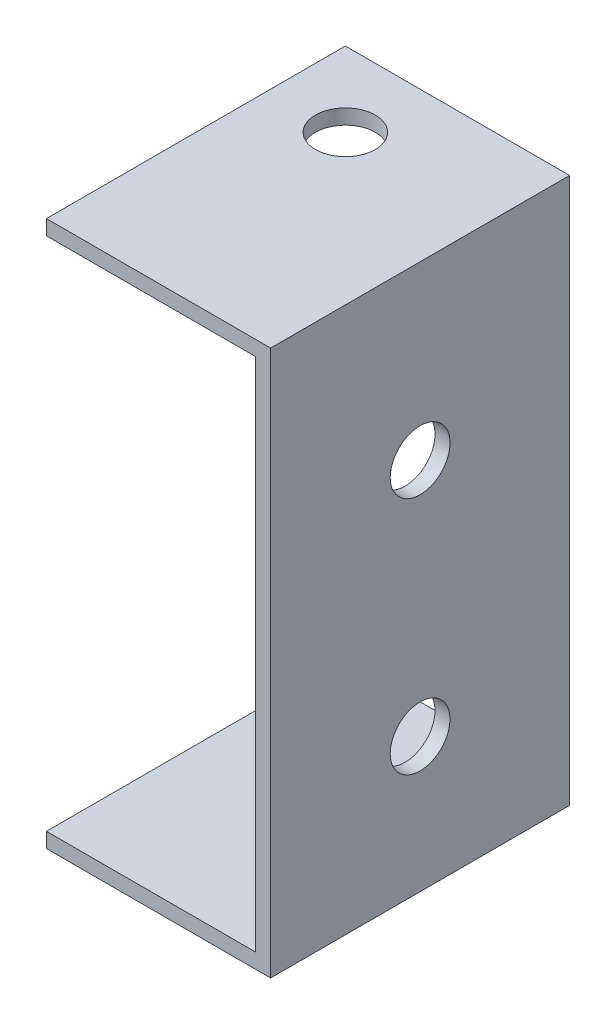
ISO-10303-21;
HEADER;
FILE_DESCRIPTION(('STEP AP214'),'2;1');
FILE_NAME('part.step','',(''),(''),'','','');
FILE_SCHEMA(('AUTOMOTIVE_DESIGN { 1 0 10303 214 1 1 1 1 }'));
ENDSEC;
DATA;
#1=APPLICATION_CONTEXT('core data for automotive mechanical design processes');
#2=APPLICATION_PROTOCOL_DEFINITION('international standard','automotive_design',2000,#1);
#3=PRODUCT_CONTEXT('',#1,'mechanical');
#4=PRODUCT('Part','Part','',(#3));
#5=PRODUCT_RELATED_PRODUCT_CATEGORY('part','',(#4));
#6=PRODUCT_DEFINITION_FORMATION('','',#4);
#7=PRODUCT_DEFINITION_CONTEXT('part definition',#1,'design');
#8=PRODUCT_DEFINITION('design','',#6,#7);
#9=PRODUCT_DEFINITION_SHAPE('','',#8);
#10=(LENGTH_UNIT() NAMED_UNIT(*) SI_UNIT(.MILLI.,.METRE.));
#11=(NAMED_UNIT(*) PLANE_ANGLE_UNIT() SI_UNIT($,.RADIAN.));
#12=(NAMED_UNIT(*) SI_UNIT($,.STERADIAN.) SOLID_ANGLE_UNIT());
#13=UNCERTAINTY_MEASURE_WITH_UNIT(LENGTH_MEASURE(1.E-05),#10,'distance_accuracy_value','');
#14=(GEOMETRIC_REPRESENTATION_CONTEXT(3) GLOBAL_UNCERTAINTY_ASSIGNED_CONTEXT((#13)) GLOBAL_UNIT_ASSIGNED_CONTEXT((#10,
#11,#12)) REPRESENTATION_CONTEXT('',''));
#15=CARTESIAN_POINT('',(0.,0.,0.));
#16=DIRECTION('',(0.,0.,1.));
#17=DIRECTION('',(1.,0.,0.));
#18=AXIS2_PLACEMENT_3D('',#15,#16,#17);
#19=CARTESIAN_POINT('',(-61.1657608940353,44.9950245879445,40.));
#20=DIRECTION('',(1.,0.,0.));
#21=DIRECTION('',(0.,0.,-1.));
#22=AXIS2_PLACEMENT_3D('',#19,#20,#21);
#23=PLANE('',#22);
#24=DIRECTION('',(0.,-1.,0.));
#25=VECTOR('',#24,1.);
#26=CARTESIAN_POINT('',(-61.1657608940353,44.9950245879445,0.));
#27=LINE('',#26,#25);
#28=CARTESIAN_POINT('',(-61.1657608940353,46.9950245879445,0.));
#29=VERTEX_POINT('',#28);
#30=CARTESIAN_POINT('',(-61.1657608940353,44.9950245879445,0.));
#31=VERTEX_POINT('',#30);
#32=EDGE_CURVE('E133',#29,#31,#27,.T.);
#33=ORIENTED_EDGE('',*,*,#32,.T.);
#34=DIRECTION('',(0.,0.,-1.));
#35=VECTOR('',#34,1.);
#36=CARTESIAN_POINT('',(-61.1657608940353,44.9950245879445,40.));
#37=LINE('',#36,#35);
#38=CARTESIAN_POINT('',(-61.1657608940353,44.9950245879445,40.));
#39=VERTEX_POINT('',#38);
#40=EDGE_CURVE('E11',#39,#31,#37,.T.);
#41=ORIENTED_EDGE('',*,*,#40,.F.);
#42=DIRECTION('',(0.,-1.,0.));
#43=VECTOR('',#42,1.);
#44=CARTESIAN_POINT('',(-61.1657608940353,44.9950245879445,40.));
#45=LINE('',#44,#43);
#46=CARTESIAN_POINT('',(-61.1657608940353,46.9950245879445,40.));
#47=VERTEX_POINT('',#46);
#48=EDGE_CURVE('E147',#47,#39,#45,.T.);
#49=ORIENTED_EDGE('',*,*,#48,.F.);
#50=DIRECTION('',(0.,0.,-1.));
#51=VECTOR('',#50,1.);
#52=CARTESIAN_POINT('',(-61.1657608940353,46.9950245879445,40.));
#53=LINE('',#52,#51);
#54=EDGE_CURVE('E129',#47,#29,#53,.T.);
#55=ORIENTED_EDGE('',*,*,#54,.T.);
#56=EDGE_LOOP('',(#33,#41,#49,#55));
#57=FACE_BOUND('',#56,.T.);
#58=ADVANCED_FACE('F35',(#57),#23,.F.);
#59=CARTESIAN_POINT('',(-33.1657608940353,44.9950245879445,40.));
#60=DIRECTION('',(0.,1.,0.));
#61=DIRECTION('',(0.,0.,1.));
#62=AXIS2_PLACEMENT_3D('',#59,#60,#61);
#63=PLANE('',#62);
#64=CARTESIAN_POINT('',(-51.1657608940353,44.9950245879445,10.));
#65=DIRECTION('',(0.,1.,0.));
#66=DIRECTION('',(0.,0.,1.));
#67=AXIS2_PLACEMENT_3D('',#64,#65,#66);
#68=CIRCLE('',#67,4.);
#69=CARTESIAN_POINT('',(-51.1657608940353,44.9950245879445,14.));
#70=VERTEX_POINT('',#69);
#71=EDGE_CURVE('E170',#70,#70,#68,.T.);
#72=ORIENTED_EDGE('',*,*,#71,.T.);
#73=EDGE_LOOP('',(#72));
#74=FACE_BOUND('',#73,.T.);
#75=DIRECTION('',(1.,0.,0.));
#76=VECTOR('',#75,1.);
#77=CARTESIAN_POINT('',(-33.1657608940353,44.9950245879445,0.));
#78=LINE('',#77,#76);
#79=CARTESIAN_POINT('',(-33.1657608940353,44.9950245879445,0.));
#80=VERTEX_POINT('',#79);
#81=EDGE_CURVE('E136',#31,#80,#78,.T.);
#82=ORIENTED_EDGE('',*,*,#81,.T.);
#83=DIRECTION('',(0.,0.,-1.));
#84=VECTOR('',#83,1.);
#85=CARTESIAN_POINT('',(-33.1657608940353,44.9950245879445,40.));
#86=LINE('',#85,#84);
#87=CARTESIAN_POINT('',(-33.1657608940353,44.9950245879445,40.));
#88=VERTEX_POINT('',#87);
#89=EDGE_CURVE('E44',#88,#80,#86,.T.);
#90=ORIENTED_EDGE('',*,*,#89,.F.);
#91=DIRECTION('',(1.,0.,0.));
#92=VECTOR('',#91,1.);
#93=CARTESIAN_POINT('',(-33.1657608940353,44.9950245879445,40.));
#94=LINE('',#93,#92);
#95=EDGE_CURVE('E96',#39,#88,#94,.T.);
#96=ORIENTED_EDGE('',*,*,#95,.F.);
#97=ORIENTED_EDGE('',*,*,#40,.T.);
#98=EDGE_LOOP('',(#82,#90,#96,#97));
#99=FACE_BOUND('',#98,.T.);
#100=ADVANCED_FACE('F211',(#74,#99),#63,.F.);
#101=CARTESIAN_POINT('',(-33.1657608940353,-24.0049754120555,40.));
#102=DIRECTION('',(1.,0.,0.));
#103=DIRECTION('',(0.,0.,-1.));
#104=AXIS2_PLACEMENT_3D('',#101,#102,#103);
#105=PLANE('',#104);
#106=CARTESIAN_POINT('',(-33.1657608940353,23.9950245879445,20.));
#107=DIRECTION('',(-1.,0.,0.));
#108=DIRECTION('',(0.,0.,1.));
#109=AXIS2_PLACEMENT_3D('',#106,#107,#108);
#110=CIRCLE('',#109,4.);
#111=CARTESIAN_POINT('',(-33.1657608940353,23.9950245879445,24.));
#112=VERTEX_POINT('',#111);
#113=EDGE_CURVE('E160',#112,#112,#110,.T.);
#114=ORIENTED_EDGE('',*,*,#113,.F.);
#115=EDGE_LOOP('',(#114));
#116=FACE_BOUND('',#115,.T.);
#117=CARTESIAN_POINT('',(-33.1657608940353,-8.00497541205545,20.));
#118=DIRECTION('',(-1.,0.,0.));
#119=DIRECTION('',(0.,0.,1.));
#120=AXIS2_PLACEMENT_3D('',#117,#118,#119);
#121=CIRCLE('',#120,4.);
#122=CARTESIAN_POINT('',(-33.1657608940353,-8.00497541205545,24.));
#123=VERTEX_POINT('',#122);
#124=EDGE_CURVE('E165',#123,#123,#121,.T.);
#125=ORIENTED_EDGE('',*,*,#124,.F.);
#126=EDGE_LOOP('',(#125));
#127=FACE_BOUND('',#126,.T.);
#128=DIRECTION('',(0.,-1.,0.));
#129=VECTOR('',#128,1.);
#130=CARTESIAN_POINT('',(-33.1657608940353,-24.0049754120555,0.));
#131=LINE('',#130,#129);
#132=CARTESIAN_POINT('',(-33.1657608940353,-24.0049754120555,0.));
#133=VERTEX_POINT('',#132);
#134=EDGE_CURVE('E138',#80,#133,#131,.T.);
#135=ORIENTED_EDGE('',*,*,#134,.T.);
#136=DIRECTION('',(0.,0.,-1.));
#137=VECTOR('',#136,1.);
#138=CARTESIAN_POINT('',(-33.1657608940353,-24.0049754120555,40.));
#139=LINE('',#138,#137);
#140=CARTESIAN_POINT('',(-33.1657608940353,-24.0049754120555,40.));
#141=VERTEX_POINT('',#140);
#142=EDGE_CURVE('E154',#141,#133,#139,.T.);
#143=ORIENTED_EDGE('',*,*,#142,.F.);
#144=DIRECTION('',(0.,-1.,0.));
#145=VECTOR('',#144,1.);
#146=CARTESIAN_POINT('',(-33.1657608940353,-24.0049754120555,40.));
#147=LINE('',#146,#145);
#148=EDGE_CURVE('E177',#88,#141,#147,.T.);
#149=ORIENTED_EDGE('',*,*,#148,.F.);
#150=ORIENTED_EDGE('',*,*,#89,.T.);
#151=EDGE_LOOP('',(#135,#143,#149,#150));
#152=FACE_BOUND('',#151,.T.);
#153=ADVANCED_FACE('F215',(#116,#127,#152),#105,.F.);
#154=CARTESIAN_POINT('',(-61.1657608940353,-24.0049754120555,40.));
#155=DIRECTION('',(0.,-1.,0.));
#156=DIRECTION('',(0.,0.,-1.));
#157=AXIS2_PLACEMENT_3D('',#154,#155,#156);
#158=PLANE('',#157);
#159=CARTESIAN_POINT('',(-51.1657608940353,-24.0049754120555,10.));
#160=DIRECTION('',(0.,-1.,0.));
#161=DIRECTION('',(0.,0.,-1.));
#162=AXIS2_PLACEMENT_3D('',#159,#160,#161);
#163=CIRCLE('',#162,4.);
#164=CARTESIAN_POINT('',(-51.1657608940353,-24.0049754120555,6.));
#165=VERTEX_POINT('',#164);
#166=EDGE_CURVE('E237',#165,#165,#163,.T.);
#167=ORIENTED_EDGE('',*,*,#166,.T.);
#168=EDGE_LOOP('',(#167));
#169=FACE_BOUND('',#168,.T.);
#170=DIRECTION('',(-1.,0.,0.));
#171=VECTOR('',#170,1.);
#172=CARTESIAN_POINT('',(-61.1657608940353,-24.0049754120555,0.));
#173=LINE('',#172,#171);
#174=CARTESIAN_POINT('',(-61.1657608940353,-24.0049754120555,0.));
#175=VERTEX_POINT('',#174);
#176=EDGE_CURVE('E140',#133,#175,#173,.T.);
#177=ORIENTED_EDGE('',*,*,#176,.T.);
#178=DIRECTION('',(0.,0.,-1.));
#179=VECTOR('',#178,1.);
#180=CARTESIAN_POINT('',(-61.1657608940353,-24.0049754120555,40.));
#181=LINE('',#180,#179);
#182=CARTESIAN_POINT('',(-61.1657608940353,-24.0049754120555,40.));
#183=VERTEX_POINT('',#182);
#184=EDGE_CURVE('E151',#183,#175,#181,.T.);
#185=ORIENTED_EDGE('',*,*,#184,.F.);
#186=DIRECTION('',(-1.,0.,0.));
#187=VECTOR('',#186,1.);
#188=CARTESIAN_POINT('',(-61.1657608940353,-24.0049754120555,40.));
#189=LINE('',#188,#187);
#190=EDGE_CURVE('E179',#141,#183,#189,.T.);
#191=ORIENTED_EDGE('',*,*,#190,.F.);
#192=ORIENTED_EDGE('',*,*,#142,.T.);
#193=EDGE_LOOP('',(#177,#185,#191,#192));
#194=FACE_BOUND('',#193,.T.);
#195=ADVANCED_FACE('F185',(#169,#194),#158,.F.);
#196=CARTESIAN_POINT('',(-61.1657608940353,-26.0049754120555,40.));
#197=DIRECTION('',(1.,0.,0.));
#198=DIRECTION('',(0.,0.,-1.));
#199=AXIS2_PLACEMENT_3D('',#196,#197,#198);
#200=PLANE('',#199);
#201=DIRECTION('',(0.,-1.,0.));
#202=VECTOR('',#201,1.);
#203=CARTESIAN_POINT('',(-61.1657608940353,-26.0049754120555,0.));
#204=LINE('',#203,#202);
#205=CARTESIAN_POINT('',(-61.1657608940353,-26.0049754120555,0.));
#206=VERTEX_POINT('',#205);
#207=EDGE_CURVE('E142',#175,#206,#204,.T.);
#208=ORIENTED_EDGE('',*,*,#207,.T.);
#209=DIRECTION('',(0.,0.,-1.));
#210=VECTOR('',#209,1.);
#211=CARTESIAN_POINT('',(-61.1657608940353,-26.0049754120555,40.));
#212=LINE('',#211,#210);
#213=CARTESIAN_POINT('',(-61.1657608940353,-26.0049754120555,40.));
#214=VERTEX_POINT('',#213);
#215=EDGE_CURVE('E124',#214,#206,#212,.T.);
#216=ORIENTED_EDGE('',*,*,#215,.F.);
#217=DIRECTION('',(0.,-1.,0.));
#218=VECTOR('',#217,1.);
#219=CARTESIAN_POINT('',(-61.1657608940353,-26.0049754120555,40.));
#220=LINE('',#219,#218);
#221=EDGE_CURVE('E115',#183,#214,#220,.T.);
#222=ORIENTED_EDGE('',*,*,#221,.F.);
#223=ORIENTED_EDGE('',*,*,#184,.T.);
#224=EDGE_LOOP('',(#208,#216,#222,#223));
#225=FACE_BOUND('',#224,.T.);
#226=ADVANCED_FACE('F189',(#225),#200,.F.);
#227=CARTESIAN_POINT('',(-31.1657608940353,-26.0049754120555,40.));
#228=DIRECTION('',(0.,1.,0.));
#229=DIRECTION('',(0.,0.,1.));
#230=AXIS2_PLACEMENT_3D('',#227,#228,#229);
#231=PLANE('',#230);
#232=CARTESIAN_POINT('',(-51.1657608940353,-26.0049754120555,10.));
#233=DIRECTION('',(0.,1.,0.));
#234=DIRECTION('',(0.,0.,1.));
#235=AXIS2_PLACEMENT_3D('',#232,#233,#234);
#236=CIRCLE('',#235,4.);
#237=CARTESIAN_POINT('',(-51.1657608940353,-26.0049754120555,14.));
#238=VERTEX_POINT('',#237);
#239=EDGE_CURVE('E235',#238,#238,#236,.T.);
#240=ORIENTED_EDGE('',*,*,#239,.T.);
#241=EDGE_LOOP('',(#240));
#242=FACE_BOUND('',#241,.T.);
#243=DIRECTION('',(1.,0.,0.));
#244=VECTOR('',#243,1.);
#245=CARTESIAN_POINT('',(-31.1657608940353,-26.0049754120555,0.));
#246=LINE('',#245,#244);
#247=CARTESIAN_POINT('',(-31.1657608940353,-26.0049754120555,0.));
#248=VERTEX_POINT('',#247);
#249=EDGE_CURVE('E123',#206,#248,#246,.T.);
#250=ORIENTED_EDGE('',*,*,#249,.T.);
#251=DIRECTION('',(0.,0.,-1.));
#252=VECTOR('',#251,1.);
#253=CARTESIAN_POINT('',(-31.1657608940353,-26.0049754120555,40.));
#254=LINE('',#253,#252);
#255=CARTESIAN_POINT('',(-31.1657608940353,-26.0049754120555,40.));
#256=VERTEX_POINT('',#255);
#257=EDGE_CURVE('E120',#256,#248,#254,.T.);
#258=ORIENTED_EDGE('',*,*,#257,.F.);
#259=DIRECTION('',(1.,0.,0.));
#260=VECTOR('',#259,1.);
#261=CARTESIAN_POINT('',(-31.1657608940353,-26.0049754120555,40.));
#262=LINE('',#261,#260);
#263=EDGE_CURVE('E109',#214,#256,#262,.T.);
#264=ORIENTED_EDGE('',*,*,#263,.F.);
#265=ORIENTED_EDGE('',*,*,#215,.T.);
#266=EDGE_LOOP('',(#250,#258,#264,#265));
#267=FACE_BOUND('',#266,.T.);
#268=ADVANCED_FACE('F121',(#242,#267),#231,.F.);
#269=CARTESIAN_POINT('',(-31.1657608940353,46.9950245879445,40.));
#270=DIRECTION('',(-1.,0.,0.));
#271=DIRECTION('',(0.,-1.,0.));
#272=AXIS2_PLACEMENT_3D('',#269,#270,#271);
#273=PLANE('',#272);
#274=CARTESIAN_POINT('',(-31.1657608940353,23.9950245879445,20.));
#275=DIRECTION('',(-1.,0.,0.));
#276=DIRECTION('',(0.,-1.,0.));
#277=AXIS2_PLACEMENT_3D('',#274,#275,#276);
#278=CIRCLE('',#277,4.);
#279=CARTESIAN_POINT('',(-31.1657608940353,19.9950245879445,20.));
#280=VERTEX_POINT('',#279);
#281=EDGE_CURVE('E38',#280,#280,#278,.T.);
#282=ORIENTED_EDGE('',*,*,#281,.T.);
#283=EDGE_LOOP('',(#282));
#284=FACE_BOUND('',#283,.T.);
#285=CARTESIAN_POINT('',(-31.1657608940353,-8.00497541205545,20.));
#286=DIRECTION('',(-1.,0.,0.));
#287=DIRECTION('',(0.,-1.,0.));
#288=AXIS2_PLACEMENT_3D('',#285,#286,#287);
#289=CIRCLE('',#288,4.);
#290=CARTESIAN_POINT('',(-31.1657608940353,-12.0049754120555,20.));
#291=VERTEX_POINT('',#290);
#292=EDGE_CURVE('E158',#291,#291,#289,.T.);
#293=ORIENTED_EDGE('',*,*,#292,.T.);
#294=EDGE_LOOP('',(#293));
#295=FACE_BOUND('',#294,.T.);
#296=DIRECTION('',(0.,1.,0.));
#297=VECTOR('',#296,1.);
#298=CARTESIAN_POINT('',(-31.1657608940353,46.9950245879445,0.));
#299=LINE('',#298,#297);
#300=CARTESIAN_POINT('',(-31.1657608940353,46.9950245879445,0.));
#301=VERTEX_POINT('',#300);
#302=EDGE_CURVE('E82',#248,#301,#299,.T.);
#303=ORIENTED_EDGE('',*,*,#302,.T.);
#304=DIRECTION('',(0.,0.,-1.));
#305=VECTOR('',#304,1.);
#306=CARTESIAN_POINT('',(-31.1657608940353,46.9950245879445,40.));
#307=LINE('',#306,#305);
#308=CARTESIAN_POINT('',(-31.1657608940353,46.9950245879445,40.));
#309=VERTEX_POINT('',#308);
#310=EDGE_CURVE('E125',#309,#301,#307,.T.);
#311=ORIENTED_EDGE('',*,*,#310,.F.);
#312=DIRECTION('',(0.,1.,0.));
#313=VECTOR('',#312,1.);
#314=CARTESIAN_POINT('',(-31.1657608940353,46.9950245879445,40.));
#315=LINE('',#314,#313);
#316=EDGE_CURVE('E113',#256,#309,#315,.T.);
#317=ORIENTED_EDGE('',*,*,#316,.F.);
#318=ORIENTED_EDGE('',*,*,#257,.T.);
#319=EDGE_LOOP('',(#303,#311,#317,#318));
#320=FACE_BOUND('',#319,.T.);
#321=ADVANCED_FACE('F127',(#284,#295,#320),#273,.F.);
#322=CARTESIAN_POINT('',(-61.1657608940353,46.9950245879445,40.));
#323=DIRECTION('',(0.,-1.,0.));
#324=DIRECTION('',(0.,0.,-1.));
#325=AXIS2_PLACEMENT_3D('',#322,#323,#324);
#326=PLANE('',#325);
#327=CARTESIAN_POINT('',(-51.1657608940353,46.9950245879445,10.));
#328=DIRECTION('',(0.,1.,0.));
#329=DIRECTION('',(0.,0.,1.));
#330=AXIS2_PLACEMENT_3D('',#327,#328,#329);
#331=CIRCLE('',#330,4.);
#332=CARTESIAN_POINT('',(-51.1657608940353,46.9950245879445,14.));
#333=VERTEX_POINT('',#332);
#334=EDGE_CURVE('E238',#333,#333,#331,.T.);
#335=ORIENTED_EDGE('',*,*,#334,.F.);
#336=EDGE_LOOP('',(#335));
#337=FACE_BOUND('',#336,.T.);
#338=DIRECTION('',(-1.,0.,0.));
#339=VECTOR('',#338,1.);
#340=CARTESIAN_POINT('',(-61.1657608940353,46.9950245879445,0.));
#341=LINE('',#340,#339);
#342=EDGE_CURVE('E88',#301,#29,#341,.T.);
#343=ORIENTED_EDGE('',*,*,#342,.T.);
#344=ORIENTED_EDGE('',*,*,#54,.F.);
#345=DIRECTION('',(-1.,0.,0.));
#346=VECTOR('',#345,1.);
#347=CARTESIAN_POINT('',(-61.1657608940353,46.9950245879445,40.));
#348=LINE('',#347,#346);
#349=EDGE_CURVE('E53',#309,#47,#348,.T.);
#350=ORIENTED_EDGE('',*,*,#349,.F.);
#351=ORIENTED_EDGE('',*,*,#310,.T.);
#352=EDGE_LOOP('',(#343,#344,#350,#351));
#353=FACE_BOUND('',#352,.T.);
#354=ADVANCED_FACE('F197',(#337,#353),#326,.F.);
#355=CARTESIAN_POINT('',(0.,0.,40.));
#356=DIRECTION('',(0.,0.,-1.));
#357=DIRECTION('',(-1.,0.,0.));
#358=AXIS2_PLACEMENT_3D('',#355,#356,#357);
#359=PLANE('',#358);
#360=ORIENTED_EDGE('',*,*,#48,.T.);
#361=ORIENTED_EDGE('',*,*,#95,.T.);
#362=ORIENTED_EDGE('',*,*,#148,.T.);
#363=ORIENTED_EDGE('',*,*,#190,.T.);
#364=ORIENTED_EDGE('',*,*,#221,.T.);
#365=ORIENTED_EDGE('',*,*,#263,.T.);
#366=ORIENTED_EDGE('',*,*,#316,.T.);
#367=ORIENTED_EDGE('',*,*,#349,.T.);
#368=EDGE_LOOP('',(#360,#361,#362,#363,#364,#365,#366,#367));
#369=FACE_BOUND('',#368,.T.);
#370=ADVANCED_FACE('F111',(#369),#359,.F.);
#371=CARTESIAN_POINT('',(0.,0.,0.));
#372=DIRECTION('',(0.,0.,-1.));
#373=DIRECTION('',(-1.,0.,0.));
#374=AXIS2_PLACEMENT_3D('',#371,#372,#373);
#375=PLANE('',#374);
#376=ORIENTED_EDGE('',*,*,#32,.F.);
#377=ORIENTED_EDGE('',*,*,#342,.F.);
#378=ORIENTED_EDGE('',*,*,#302,.F.);
#379=ORIENTED_EDGE('',*,*,#249,.F.);
#380=ORIENTED_EDGE('',*,*,#207,.F.);
#381=ORIENTED_EDGE('',*,*,#176,.F.);
#382=ORIENTED_EDGE('',*,*,#134,.F.);
#383=ORIENTED_EDGE('',*,*,#81,.F.);
#384=EDGE_LOOP('',(#376,#377,#378,#379,#380,#381,#382,#383));
#385=FACE_BOUND('',#384,.T.);
#386=ADVANCED_FACE('F192',(#385),#375,.T.);
#387=CARTESIAN_POINT('',(6.83423910596467,-8.00497541205545,20.));
#388=DIRECTION('',(-1.,0.,0.));
#389=DIRECTION('',(0.,0.,1.));
#390=AXIS2_PLACEMENT_3D('',#387,#388,#389);
#391=CYLINDRICAL_SURFACE('',#390,4.);
#392=ORIENTED_EDGE('',*,*,#124,.T.);
#393=EDGE_LOOP('',(#392));
#394=FACE_BOUND('',#393,.T.);
#395=ORIENTED_EDGE('',*,*,#292,.F.);
#396=EDGE_LOOP('',(#395));
#397=FACE_BOUND('',#396,.T.);
#398=ADVANCED_FACE('F255',(#394,#397),#391,.F.);
#399=CARTESIAN_POINT('',(6.83423910596467,23.9950245879445,20.));
#400=DIRECTION('',(-1.,0.,0.));
#401=DIRECTION('',(0.,0.,1.));
#402=AXIS2_PLACEMENT_3D('',#399,#400,#401);
#403=CYLINDRICAL_SURFACE('',#402,4.);
#404=ORIENTED_EDGE('',*,*,#113,.T.);
#405=EDGE_LOOP('',(#404));
#406=FACE_BOUND('',#405,.T.);
#407=ORIENTED_EDGE('',*,*,#281,.F.);
#408=EDGE_LOOP('',(#407));
#409=FACE_BOUND('',#408,.T.);
#410=ADVANCED_FACE('F248',(#406,#409),#403,.F.);
#411=CARTESIAN_POINT('',(-51.1657608940353,-49.0049754120555,10.));
#412=DIRECTION('',(0.,1.,0.));
#413=DIRECTION('',(0.,0.,1.));
#414=AXIS2_PLACEMENT_3D('',#411,#412,#413);
#415=CYLINDRICAL_SURFACE('',#414,4.);
#416=ORIENTED_EDGE('',*,*,#334,.T.);
#417=EDGE_LOOP('',(#416));
#418=FACE_BOUND('',#417,.T.);
#419=ORIENTED_EDGE('',*,*,#71,.F.);
#420=EDGE_LOOP('',(#419));
#421=FACE_BOUND('',#420,.T.);
#422=ADVANCED_FACE('F244',(#418,#421),#415,.F.);
#423=ORIENTED_EDGE('',*,*,#239,.F.);
#424=EDGE_LOOP('',(#423));
#425=FACE_BOUND('',#424,.T.);
#426=ORIENTED_EDGE('',*,*,#166,.F.);
#427=EDGE_LOOP('',(#426));
#428=FACE_BOUND('',#427,.T.);
#429=ADVANCED_FACE('F247',(#425,#428),#415,.F.);
#430=CLOSED_SHELL('',(#58,#100,#153,#195,#226,#268,#321,#354,#370,#386,#398,#410,#422,#429));
#431=MANIFOLD_SOLID_BREP('B2',#430);
#432=ADVANCED_BREP_SHAPE_REPRESENTATION('',(#18,#431),#14);
#433=SHAPE_DEFINITION_REPRESENTATION(#9,#432);
ENDSEC;
END-ISO-10303-21;
